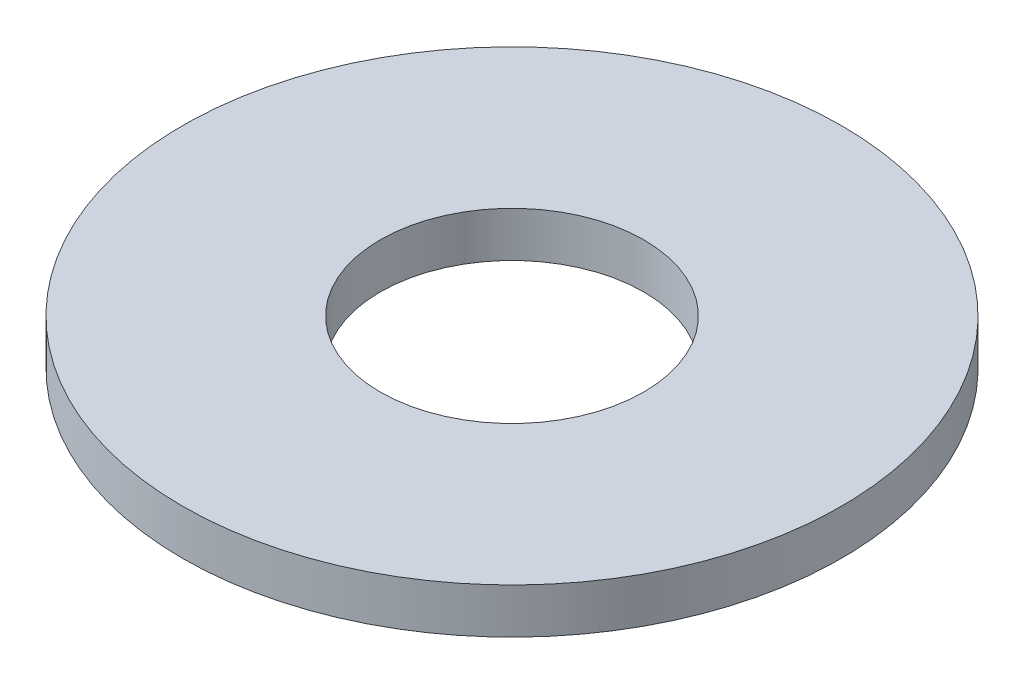
ISO-10303-21;
HEADER;
FILE_DESCRIPTION(('STEP AP214'),'2;1');
FILE_NAME('part.step','',(''),(''),'','','');
FILE_SCHEMA(('AUTOMOTIVE_DESIGN { 1 0 10303 214 1 1 1 1 }'));
ENDSEC;
DATA;
#1=APPLICATION_CONTEXT('core data for automotive mechanical design processes');
#2=APPLICATION_PROTOCOL_DEFINITION('international standard','automotive_design',2000,#1);
#3=PRODUCT_CONTEXT('',#1,'mechanical');
#4=PRODUCT('Part','Part','',(#3));
#5=PRODUCT_RELATED_PRODUCT_CATEGORY('part','',(#4));
#6=PRODUCT_DEFINITION_FORMATION('','',#4);
#7=PRODUCT_DEFINITION_CONTEXT('part definition',#1,'design');
#8=PRODUCT_DEFINITION('design','',#6,#7);
#9=PRODUCT_DEFINITION_SHAPE('','',#8);
#10=(LENGTH_UNIT() NAMED_UNIT(*) SI_UNIT(.MILLI.,.METRE.));
#11=(NAMED_UNIT(*) PLANE_ANGLE_UNIT() SI_UNIT($,.RADIAN.));
#12=(NAMED_UNIT(*) SI_UNIT($,.STERADIAN.) SOLID_ANGLE_UNIT());
#13=UNCERTAINTY_MEASURE_WITH_UNIT(LENGTH_MEASURE(1.E-05),#10,'distance_accuracy_value','');
#14=(GEOMETRIC_REPRESENTATION_CONTEXT(3) GLOBAL_UNCERTAINTY_ASSIGNED_CONTEXT((#13)) GLOBAL_UNIT_ASSIGNED_CONTEXT((#10,
#11,#12)) REPRESENTATION_CONTEXT('',''));
#15=CARTESIAN_POINT('',(0.,0.,0.));
#16=DIRECTION('',(0.,0.,1.));
#17=DIRECTION('',(1.,0.,0.));
#18=AXIS2_PLACEMENT_3D('',#15,#16,#17);
#19=CARTESIAN_POINT('',(0.,12.,0.));
#20=DIRECTION('',(0.,-1.,0.));
#21=DIRECTION('',(0.,0.,-1.));
#22=AXIS2_PLACEMENT_3D('',#19,#20,#21);
#23=CYLINDRICAL_SURFACE('',#22,87.5);
#24=CARTESIAN_POINT('',(0.,12.,0.));
#25=DIRECTION('',(0.,1.,0.));
#26=DIRECTION('',(0.,0.,1.));
#27=AXIS2_PLACEMENT_3D('',#24,#25,#26);
#28=CIRCLE('',#27,87.5);
#29=CARTESIAN_POINT('',(0.,12.,87.5));
#30=VERTEX_POINT('',#29);
#31=EDGE_CURVE('E10',#30,#30,#28,.T.);
#32=ORIENTED_EDGE('',*,*,#31,.F.);
#33=EDGE_LOOP('',(#32));
#34=FACE_BOUND('',#33,.T.);
#35=CARTESIAN_POINT('',(0.,0.,0.));
#36=DIRECTION('',(0.,1.,0.));
#37=DIRECTION('',(0.,0.,1.));
#38=AXIS2_PLACEMENT_3D('',#35,#36,#37);
#39=CIRCLE('',#38,87.5);
#40=CARTESIAN_POINT('',(0.,0.,87.5));
#41=VERTEX_POINT('',#40);
#42=EDGE_CURVE('E37',#41,#41,#39,.T.);
#43=ORIENTED_EDGE('',*,*,#42,.T.);
#44=EDGE_LOOP('',(#43));
#45=FACE_BOUND('',#44,.T.);
#46=ADVANCED_FACE('F40',(#34,#45),#23,.T.);
#47=CARTESIAN_POINT('',(0.,12.,0.));
#48=DIRECTION('',(0.,1.,0.));
#49=DIRECTION('',(0.,0.,1.));
#50=AXIS2_PLACEMENT_3D('',#47,#48,#49);
#51=PLANE('',#50);
#52=CARTESIAN_POINT('',(0.,12.,0.));
#53=DIRECTION('',(0.,1.,0.));
#54=DIRECTION('',(0.,0.,1.));
#55=AXIS2_PLACEMENT_3D('',#52,#53,#54);
#56=CIRCLE('',#55,35.);
#57=CARTESIAN_POINT('',(0.,12.,35.));
#58=VERTEX_POINT('',#57);
#59=EDGE_CURVE('E50',#58,#58,#56,.T.);
#60=ORIENTED_EDGE('',*,*,#59,.F.);
#61=EDGE_LOOP('',(#60));
#62=FACE_BOUND('',#61,.T.);
#63=ORIENTED_EDGE('',*,*,#31,.T.);
#64=EDGE_LOOP('',(#63));
#65=FACE_BOUND('',#64,.T.);
#66=ADVANCED_FACE('F59',(#62,#65),#51,.T.);
#67=CARTESIAN_POINT('',(0.,0.,0.));
#68=DIRECTION('',(0.,1.,0.));
#69=DIRECTION('',(0.,0.,1.));
#70=AXIS2_PLACEMENT_3D('',#67,#68,#69);
#71=PLANE('',#70);
#72=CARTESIAN_POINT('',(0.,0.,0.));
#73=DIRECTION('',(0.,1.,0.));
#74=DIRECTION('',(0.,0.,1.));
#75=AXIS2_PLACEMENT_3D('',#72,#73,#74);
#76=CIRCLE('',#75,35.);
#77=CARTESIAN_POINT('',(0.,0.,35.));
#78=VERTEX_POINT('',#77);
#79=EDGE_CURVE('E47',#78,#78,#76,.T.);
#80=ORIENTED_EDGE('',*,*,#79,.T.);
#81=EDGE_LOOP('',(#80));
#82=FACE_BOUND('',#81,.T.);
#83=ORIENTED_EDGE('',*,*,#42,.F.);
#84=EDGE_LOOP('',(#83));
#85=FACE_BOUND('',#84,.T.);
#86=ADVANCED_FACE('F58',(#82,#85),#71,.F.);
#87=CARTESIAN_POINT('',(0.,12.,0.));
#88=DIRECTION('',(0.,-1.,0.));
#89=DIRECTION('',(0.,0.,-1.));
#90=AXIS2_PLACEMENT_3D('',#87,#88,#89);
#91=CYLINDRICAL_SURFACE('',#90,35.);
#92=ORIENTED_EDGE('',*,*,#59,.T.);
#93=EDGE_LOOP('',(#92));
#94=FACE_BOUND('',#93,.T.);
#95=ORIENTED_EDGE('',*,*,#79,.F.);
#96=EDGE_LOOP('',(#95));
#97=FACE_BOUND('',#96,.T.);
#98=ADVANCED_FACE('F54',(#94,#97),#91,.F.);
#99=CLOSED_SHELL('',(#46,#66,#86,#98));
#100=MANIFOLD_SOLID_BREP('B2',#99);
#101=ADVANCED_BREP_SHAPE_REPRESENTATION('',(#18,#100),#14);
#102=SHAPE_DEFINITION_REPRESENTATION(#9,#101);
ENDSEC;
END-ISO-10303-21;
